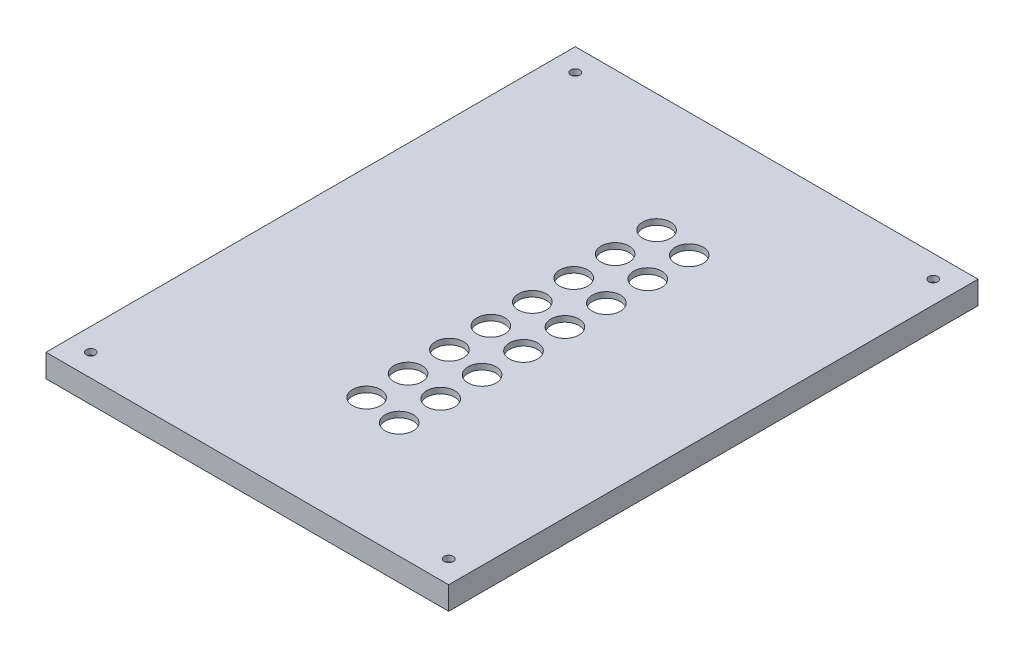
ISO-10303-21;
HEADER;
FILE_DESCRIPTION(('STEP AP214'),'2;1');
FILE_NAME('part.step','',(''),(''),'','','');
FILE_SCHEMA(('AUTOMOTIVE_DESIGN { 1 0 10303 214 1 1 1 1 }'));
ENDSEC;
DATA;
#1=APPLICATION_CONTEXT('core data for automotive mechanical design processes');
#2=APPLICATION_PROTOCOL_DEFINITION('international standard','automotive_design',2000,#1);
#3=PRODUCT_CONTEXT('',#1,'mechanical');
#4=PRODUCT('Part','Part','',(#3));
#5=PRODUCT_RELATED_PRODUCT_CATEGORY('part','',(#4));
#6=PRODUCT_DEFINITION_FORMATION('','',#4);
#7=PRODUCT_DEFINITION_CONTEXT('part definition',#1,'design');
#8=PRODUCT_DEFINITION('design','',#6,#7);
#9=PRODUCT_DEFINITION_SHAPE('','',#8);
#10=(LENGTH_UNIT() NAMED_UNIT(*) SI_UNIT(.MILLI.,.METRE.));
#11=(NAMED_UNIT(*) PLANE_ANGLE_UNIT() SI_UNIT($,.RADIAN.));
#12=(NAMED_UNIT(*) SI_UNIT($,.STERADIAN.) SOLID_ANGLE_UNIT());
#13=UNCERTAINTY_MEASURE_WITH_UNIT(LENGTH_MEASURE(1.E-05),#10,'distance_accuracy_value','');
#14=(GEOMETRIC_REPRESENTATION_CONTEXT(3) GLOBAL_UNCERTAINTY_ASSIGNED_CONTEXT((#13)) GLOBAL_UNIT_ASSIGNED_CONTEXT((#10,
#11,#12)) REPRESENTATION_CONTEXT('',''));
#15=CARTESIAN_POINT('',(0.,0.,0.));
#16=DIRECTION('',(0.,0.,1.));
#17=DIRECTION('',(1.,0.,0.));
#18=AXIS2_PLACEMENT_3D('',#15,#16,#17);
#19=CARTESIAN_POINT('',(0.,3.175,0.));
#20=DIRECTION('',(0.,1.,0.));
#21=DIRECTION('',(0.,0.,1.));
#22=AXIS2_PLACEMENT_3D('',#19,#20,#21);
#23=PLANE('',#22);
#24=CARTESIAN_POINT('',(-69.6461813930733,3.175,-110.086655576052));
#25=DIRECTION('',(0.,1.,0.));
#26=DIRECTION('',(0.,0.,1.));
#27=AXIS2_PLACEMENT_3D('',#24,#25,#26);
#28=CIRCLE('',#27,7.73912599999998);
#29=CARTESIAN_POINT('',(-69.6461813930733,3.175,-102.347529576052));
#30=VERTEX_POINT('',#29);
#31=EDGE_CURVE('E243',#30,#30,#28,.T.);
#32=ORIENTED_EDGE('',*,*,#31,.F.);
#33=EDGE_LOOP('',(#32));
#34=FACE_BOUND('',#33,.T.);
#35=CARTESIAN_POINT('',(-48.64618139661,3.175,-107.086655551295));
#36=DIRECTION('',(0.,1.,0.));
#37=DIRECTION('',(0.,0.,1.));
#38=AXIS2_PLACEMENT_3D('',#35,#36,#37);
#39=CIRCLE('',#38,7.73912599999998);
#40=CARTESIAN_POINT('',(-48.64618139661,3.175,-99.347529551295));
#41=VERTEX_POINT('',#40);
#42=EDGE_CURVE('E233',#41,#41,#39,.T.);
#43=ORIENTED_EDGE('',*,*,#42,.F.);
#44=EDGE_LOOP('',(#43));
#45=FACE_BOUND('',#44,.T.);
#46=CARTESIAN_POINT('',(-69.6461813898682,3.175,-87.2266555760518));
#47=DIRECTION('',(0.,1.,0.));
#48=DIRECTION('',(0.,0.,1.));
#49=AXIS2_PLACEMENT_3D('',#46,#47,#48);
#50=CIRCLE('',#49,7.73912599999998);
#51=CARTESIAN_POINT('',(-69.6461813898682,3.175,-79.4875295760518));
#52=VERTEX_POINT('',#51);
#53=EDGE_CURVE('E230',#52,#52,#50,.T.);
#54=ORIENTED_EDGE('',*,*,#53,.F.);
#55=EDGE_LOOP('',(#54));
#56=FACE_BOUND('',#55,.T.);
#57=CARTESIAN_POINT('',(-48.6461813934049,3.175,-84.226655551295));
#58=DIRECTION('',(0.,1.,0.));
#59=DIRECTION('',(0.,0.,1.));
#60=AXIS2_PLACEMENT_3D('',#57,#58,#59);
#61=CIRCLE('',#60,7.73912599999998);
#62=CARTESIAN_POINT('',(-48.6461813934049,3.175,-76.487529551295));
#63=VERTEX_POINT('',#62);
#64=EDGE_CURVE('E229',#63,#63,#61,.T.);
#65=ORIENTED_EDGE('',*,*,#64,.F.);
#66=EDGE_LOOP('',(#65));
#67=FACE_BOUND('',#66,.T.);
#68=CARTESIAN_POINT('',(-48.6461813901998,3.175,-61.366655551295));
#69=DIRECTION('',(0.,1.,0.));
#70=DIRECTION('',(0.,0.,1.));
#71=AXIS2_PLACEMENT_3D('',#68,#69,#70);
#72=CIRCLE('',#71,7.73912599999998);
#73=CARTESIAN_POINT('',(-48.6461813901998,3.175,-53.627529551295));
#74=VERTEX_POINT('',#73);
#75=EDGE_CURVE('E251',#74,#74,#72,.T.);
#76=ORIENTED_EDGE('',*,*,#75,.F.);
#77=EDGE_LOOP('',(#76));
#78=FACE_BOUND('',#77,.T.);
#79=CARTESIAN_POINT('',(-69.6461813866631,3.175,-64.3666555760517));
#80=DIRECTION('',(0.,1.,0.));
#81=DIRECTION('',(0.,0.,1.));
#82=AXIS2_PLACEMENT_3D('',#79,#80,#81);
#83=CIRCLE('',#82,7.73912599999998);
#84=CARTESIAN_POINT('',(-69.6461813866631,3.175,-56.6275295760518));
#85=VERTEX_POINT('',#84);
#86=EDGE_CURVE('E226',#85,#85,#83,.T.);
#87=ORIENTED_EDGE('',*,*,#86,.F.);
#88=EDGE_LOOP('',(#87));
#89=FACE_BOUND('',#88,.T.);
#90=CARTESIAN_POINT('',(-69.646181383458,3.175,-41.5066555760518));
#91=DIRECTION('',(0.,1.,0.));
#92=DIRECTION('',(0.,0.,1.));
#93=AXIS2_PLACEMENT_3D('',#90,#91,#92);
#94=CIRCLE('',#93,7.73912599999998);
#95=CARTESIAN_POINT('',(-69.646181383458,3.175,-33.7675295760518));
#96=VERTEX_POINT('',#95);
#97=EDGE_CURVE('E225',#96,#96,#94,.T.);
#98=ORIENTED_EDGE('',*,*,#97,.F.);
#99=EDGE_LOOP('',(#98));
#100=FACE_BOUND('',#99,.T.);
#101=CARTESIAN_POINT('',(-48.6461813869947,3.175,-38.506655551295));
#102=DIRECTION('',(0.,1.,0.));
#103=DIRECTION('',(0.,0.,1.));
#104=AXIS2_PLACEMENT_3D('',#101,#102,#103);
#105=CIRCLE('',#104,7.73912599999998);
#106=CARTESIAN_POINT('',(-48.6461813869947,3.175,-30.767529551295));
#107=VERTEX_POINT('',#106);
#108=EDGE_CURVE('E264',#107,#107,#105,.T.);
#109=ORIENTED_EDGE('',*,*,#108,.F.);
#110=EDGE_LOOP('',(#109));
#111=FACE_BOUND('',#110,.T.);
#112=CARTESIAN_POINT('',(-48.6461813837896,3.175,-15.646655551295));
#113=DIRECTION('',(0.,1.,0.));
#114=DIRECTION('',(0.,0.,1.));
#115=AXIS2_PLACEMENT_3D('',#112,#113,#114);
#116=CIRCLE('',#115,7.73912599999998);
#117=CARTESIAN_POINT('',(-48.6461813837896,3.175,-7.90752955129499));
#118=VERTEX_POINT('',#117);
#119=EDGE_CURVE('E221',#118,#118,#116,.T.);
#120=ORIENTED_EDGE('',*,*,#119,.F.);
#121=EDGE_LOOP('',(#120));
#122=FACE_BOUND('',#121,.T.);
#123=CARTESIAN_POINT('',(-69.646181380253,3.175,-18.6466555760518));
#124=DIRECTION('',(0.,1.,0.));
#125=DIRECTION('',(0.,0.,1.));
#126=AXIS2_PLACEMENT_3D('',#123,#124,#125);
#127=CIRCLE('',#126,7.73912599999998);
#128=CARTESIAN_POINT('',(-69.646181380253,3.175,-10.9075295760518));
#129=VERTEX_POINT('',#128);
#130=EDGE_CURVE('E220',#129,#129,#127,.T.);
#131=ORIENTED_EDGE('',*,*,#130,.F.);
#132=EDGE_LOOP('',(#131));
#133=FACE_BOUND('',#132,.T.);
#134=CARTESIAN_POINT('',(-69.6461813770479,3.175,4.21334442394824));
#135=DIRECTION('',(0.,1.,0.));
#136=DIRECTION('',(0.,0.,1.));
#137=AXIS2_PLACEMENT_3D('',#134,#135,#136);
#138=CIRCLE('',#137,7.73912599999998);
#139=CARTESIAN_POINT('',(-69.6461813770479,3.175,11.9524704239482));
#140=VERTEX_POINT('',#139);
#141=EDGE_CURVE('E216',#140,#140,#138,.T.);
#142=ORIENTED_EDGE('',*,*,#141,.F.);
#143=EDGE_LOOP('',(#142));
#144=FACE_BOUND('',#143,.T.);
#145=CARTESIAN_POINT('',(-48.6461813805845,3.175,7.21334444870503));
#146=DIRECTION('',(0.,1.,0.));
#147=DIRECTION('',(0.,0.,1.));
#148=AXIS2_PLACEMENT_3D('',#145,#146,#147);
#149=CIRCLE('',#148,7.73912599999998);
#150=CARTESIAN_POINT('',(-48.6461813805845,3.175,14.952470448705));
#151=VERTEX_POINT('',#150);
#152=EDGE_CURVE('E212',#151,#151,#149,.T.);
#153=ORIENTED_EDGE('',*,*,#152,.F.);
#154=EDGE_LOOP('',(#153));
#155=FACE_BOUND('',#154,.T.);
#156=CARTESIAN_POINT('',(-48.6461813773795,3.175,30.073344448705));
#157=DIRECTION('',(0.,1.,0.));
#158=DIRECTION('',(0.,0.,1.));
#159=AXIS2_PLACEMENT_3D('',#156,#157,#158);
#160=CIRCLE('',#159,7.73912599999998);
#161=CARTESIAN_POINT('',(-48.6461813773795,3.175,37.812470448705));
#162=VERTEX_POINT('',#161);
#163=EDGE_CURVE('E208',#162,#162,#160,.T.);
#164=ORIENTED_EDGE('',*,*,#163,.F.);
#165=EDGE_LOOP('',(#164));
#166=FACE_BOUND('',#165,.T.);
#167=CARTESIAN_POINT('',(-69.6461813738428,3.175,27.0733444239482));
#168=DIRECTION('',(0.,1.,0.));
#169=DIRECTION('',(0.,0.,1.));
#170=AXIS2_PLACEMENT_3D('',#167,#168,#169);
#171=CIRCLE('',#170,7.73912599999998);
#172=CARTESIAN_POINT('',(-69.6461813738428,3.175,34.8124704239482));
#173=VERTEX_POINT('',#172);
#174=EDGE_CURVE('E204',#173,#173,#171,.T.);
#175=ORIENTED_EDGE('',*,*,#174,.F.);
#176=EDGE_LOOP('',(#175));
#177=FACE_BOUND('',#176,.T.);
#178=CARTESIAN_POINT('',(-69.6461813706377,3.175,49.9333444239482));
#179=DIRECTION('',(0.,1.,0.));
#180=DIRECTION('',(0.,0.,1.));
#181=AXIS2_PLACEMENT_3D('',#178,#179,#180);
#182=CIRCLE('',#181,7.73912599999998);
#183=CARTESIAN_POINT('',(-69.6461813706377,3.175,57.6724704239482));
#184=VERTEX_POINT('',#183);
#185=EDGE_CURVE('E200',#184,#184,#182,.T.);
#186=ORIENTED_EDGE('',*,*,#185,.F.);
#187=EDGE_LOOP('',(#186));
#188=FACE_BOUND('',#187,.T.);
#189=CARTESIAN_POINT('',(-48.6461813741744,3.175,52.933344448705));
#190=DIRECTION('',(0.,1.,0.));
#191=DIRECTION('',(0.,0.,1.));
#192=AXIS2_PLACEMENT_3D('',#189,#190,#191);
#193=CIRCLE('',#192,7.73912599999998);
#194=CARTESIAN_POINT('',(-48.6461813741744,3.175,60.672470448705));
#195=VERTEX_POINT('',#194);
#196=EDGE_CURVE('E127',#195,#195,#193,.T.);
#197=ORIENTED_EDGE('',*,*,#196,.F.);
#198=EDGE_LOOP('',(#197));
#199=FACE_BOUND('',#198,.T.);
#200=CARTESIAN_POINT('',(30.1288186462325,3.175,104.399444444444));
#201=DIRECTION('',(0.,1.,0.));
#202=DIRECTION('',(0.,0.,1.));
#203=AXIS2_PLACEMENT_3D('',#200,#201,#202);
#204=CIRCLE('',#203,2.52729999999998);
#205=CARTESIAN_POINT('',(30.1288186462325,3.175,106.926744444444));
#206=VERTEX_POINT('',#205);
#207=EDGE_CURVE('E184',#206,#206,#204,.T.);
#208=ORIENTED_EDGE('',*,*,#207,.F.);
#209=EDGE_LOOP('',(#208));
#210=FACE_BOUND('',#209,.T.);
#211=CARTESIAN_POINT('',(-167.421181353768,3.175,104.399444444444));
#212=DIRECTION('',(0.,1.,0.));
#213=DIRECTION('',(0.,0.,1.));
#214=AXIS2_PLACEMENT_3D('',#211,#212,#213);
#215=CIRCLE('',#214,2.52729999999998);
#216=CARTESIAN_POINT('',(-167.421181353768,3.175,106.926744444444));
#217=VERTEX_POINT('',#216);
#218=EDGE_CURVE('E11',#217,#217,#215,.T.);
#219=ORIENTED_EDGE('',*,*,#218,.F.);
#220=EDGE_LOOP('',(#219));
#221=FACE_BOUND('',#220,.T.);
#222=CARTESIAN_POINT('',(-167.421181353768,3.175,-163.000555634));
#223=DIRECTION('',(0.,1.,0.));
#224=DIRECTION('',(0.,0.,1.));
#225=AXIS2_PLACEMENT_3D('',#222,#223,#224);
#226=CIRCLE('',#225,2.52729999999998);
#227=CARTESIAN_POINT('',(-167.421181353768,3.175,-160.473255634));
#228=VERTEX_POINT('',#227);
#229=EDGE_CURVE('E190',#228,#228,#226,.T.);
#230=ORIENTED_EDGE('',*,*,#229,.F.);
#231=EDGE_LOOP('',(#230));
#232=FACE_BOUND('',#231,.T.);
#233=CARTESIAN_POINT('',(30.1288186462324,3.175,-163.000555634));
#234=DIRECTION('',(0.,1.,0.));
#235=DIRECTION('',(0.,0.,1.));
#236=AXIS2_PLACEMENT_3D('',#233,#234,#235);
#237=CIRCLE('',#236,2.52729999999998);
#238=CARTESIAN_POINT('',(30.1288186462324,3.175,-160.473255634));
#239=VERTEX_POINT('',#238);
#240=EDGE_CURVE('E178',#239,#239,#237,.T.);
#241=ORIENTED_EDGE('',*,*,#240,.F.);
#242=EDGE_LOOP('',(#241));
#243=FACE_BOUND('',#242,.T.);
#244=DIRECTION('',(0.,0.,1.));
#245=VECTOR('',#244,1.);
#246=CARTESIAN_POINT('',(-179.771181353768,3.175,-175.350551));
#247=LINE('',#246,#245);
#248=CARTESIAN_POINT('',(-179.771181353768,3.175,-175.350551));
#249=VERTEX_POINT('',#248);
#250=CARTESIAN_POINT('',(-179.771181353768,3.175,116.749444444444));
#251=VERTEX_POINT('',#250);
#252=EDGE_CURVE('E135',#249,#251,#247,.T.);
#253=ORIENTED_EDGE('',*,*,#252,.T.);
#254=DIRECTION('',(1.,0.,0.));
#255=VECTOR('',#254,1.);
#256=CARTESIAN_POINT('',(-179.771181353768,3.175,116.749444444444));
#257=LINE('',#256,#255);
#258=CARTESIAN_POINT('',(42.4788186462324,3.175,116.749444444444));
#259=VERTEX_POINT('',#258);
#260=EDGE_CURVE('E155',#251,#259,#257,.T.);
#261=ORIENTED_EDGE('',*,*,#260,.T.);
#262=DIRECTION('',(0.,0.,-1.));
#263=VECTOR('',#262,1.);
#264=CARTESIAN_POINT('',(42.4788186462324,3.175,116.749444444444));
#265=LINE('',#264,#263);
#266=CARTESIAN_POINT('',(42.4788186462324,3.175,-175.350551));
#267=VERTEX_POINT('',#266);
#268=EDGE_CURVE('E158',#259,#267,#265,.T.);
#269=ORIENTED_EDGE('',*,*,#268,.T.);
#270=DIRECTION('',(-1.,0.,0.));
#271=VECTOR('',#270,1.);
#272=CARTESIAN_POINT('',(42.4788186462324,3.175,-175.350551));
#273=LINE('',#272,#271);
#274=EDGE_CURVE('E143',#267,#249,#273,.T.);
#275=ORIENTED_EDGE('',*,*,#274,.T.);
#276=EDGE_LOOP('',(#253,#261,#269,#275));
#277=FACE_BOUND('',#276,.T.);
#278=ADVANCED_FACE('F35',(#34,#45,#56,#67,#78,#89,#100,#111,#122,#133,#144,#155,#166,#177,#188,
#199,#210,#221,#232,#243,#277),#23,.T.);
#279=CARTESIAN_POINT('',(0.,0.,0.));
#280=DIRECTION('',(0.,1.,0.));
#281=DIRECTION('',(0.,0.,1.));
#282=AXIS2_PLACEMENT_3D('',#279,#280,#281);
#283=PLANE('',#282);
#284=CARTESIAN_POINT('',(-69.6461813930733,0.,-110.086655576052));
#285=DIRECTION('',(0.,1.,0.));
#286=DIRECTION('',(0.,0.,1.));
#287=AXIS2_PLACEMENT_3D('',#284,#285,#286);
#288=CIRCLE('',#287,7.73912599999999);
#289=CARTESIAN_POINT('',(-69.6461813930733,0.,-102.347529576052));
#290=VERTEX_POINT('',#289);
#291=EDGE_CURVE('E39',#290,#290,#288,.T.);
#292=ORIENTED_EDGE('',*,*,#291,.T.);
#293=EDGE_LOOP('',(#292));
#294=FACE_BOUND('',#293,.T.);
#295=CARTESIAN_POINT('',(-48.64618139661,0.,-107.086655551295));
#296=DIRECTION('',(0.,1.,0.));
#297=DIRECTION('',(0.,0.,1.));
#298=AXIS2_PLACEMENT_3D('',#295,#296,#297);
#299=CIRCLE('',#298,7.73912599999999);
#300=CARTESIAN_POINT('',(-48.64618139661,0.,-99.347529551295));
#301=VERTEX_POINT('',#300);
#302=EDGE_CURVE('E231',#301,#301,#299,.T.);
#303=ORIENTED_EDGE('',*,*,#302,.T.);
#304=EDGE_LOOP('',(#303));
#305=FACE_BOUND('',#304,.T.);
#306=CARTESIAN_POINT('',(-69.6461813898682,0.,-87.2266555760518));
#307=DIRECTION('',(0.,1.,0.));
#308=DIRECTION('',(0.,0.,1.));
#309=AXIS2_PLACEMENT_3D('',#306,#307,#308);
#310=CIRCLE('',#309,7.73912599999999);
#311=CARTESIAN_POINT('',(-69.6461813898682,0.,-79.4875295760518));
#312=VERTEX_POINT('',#311);
#313=EDGE_CURVE('E227',#312,#312,#310,.T.);
#314=ORIENTED_EDGE('',*,*,#313,.T.);
#315=EDGE_LOOP('',(#314));
#316=FACE_BOUND('',#315,.T.);
#317=CARTESIAN_POINT('',(-48.6461813934049,0.,-84.226655551295));
#318=DIRECTION('',(0.,1.,0.));
#319=DIRECTION('',(0.,0.,1.));
#320=AXIS2_PLACEMENT_3D('',#317,#318,#319);
#321=CIRCLE('',#320,7.73912599999999);
#322=CARTESIAN_POINT('',(-48.6461813934049,0.,-76.487529551295));
#323=VERTEX_POINT('',#322);
#324=EDGE_CURVE('E248',#323,#323,#321,.T.);
#325=ORIENTED_EDGE('',*,*,#324,.T.);
#326=EDGE_LOOP('',(#325));
#327=FACE_BOUND('',#326,.T.);
#328=CARTESIAN_POINT('',(-48.6461813901998,0.,-61.366655551295));
#329=DIRECTION('',(0.,1.,0.));
#330=DIRECTION('',(0.,0.,1.));
#331=AXIS2_PLACEMENT_3D('',#328,#329,#330);
#332=CIRCLE('',#331,7.73912599999999);
#333=CARTESIAN_POINT('',(-48.6461813901998,0.,-53.627529551295));
#334=VERTEX_POINT('',#333);
#335=EDGE_CURVE('E254',#334,#334,#332,.T.);
#336=ORIENTED_EDGE('',*,*,#335,.T.);
#337=EDGE_LOOP('',(#336));
#338=FACE_BOUND('',#337,.T.);
#339=CARTESIAN_POINT('',(-69.6461813866631,0.,-64.3666555760517));
#340=DIRECTION('',(0.,1.,0.));
#341=DIRECTION('',(0.,0.,1.));
#342=AXIS2_PLACEMENT_3D('',#339,#340,#341);
#343=CIRCLE('',#342,7.73912599999999);
#344=CARTESIAN_POINT('',(-69.6461813866631,0.,-56.6275295760517));
#345=VERTEX_POINT('',#344);
#346=EDGE_CURVE('E222',#345,#345,#343,.T.);
#347=ORIENTED_EDGE('',*,*,#346,.T.);
#348=EDGE_LOOP('',(#347));
#349=FACE_BOUND('',#348,.T.);
#350=CARTESIAN_POINT('',(-69.646181383458,0.,-41.5066555760518));
#351=DIRECTION('',(0.,1.,0.));
#352=DIRECTION('',(0.,0.,1.));
#353=AXIS2_PLACEMENT_3D('',#350,#351,#352);
#354=CIRCLE('',#353,7.73912599999999);
#355=CARTESIAN_POINT('',(-69.646181383458,0.,-33.7675295760518));
#356=VERTEX_POINT('',#355);
#357=EDGE_CURVE('E261',#356,#356,#354,.T.);
#358=ORIENTED_EDGE('',*,*,#357,.T.);
#359=EDGE_LOOP('',(#358));
#360=FACE_BOUND('',#359,.T.);
#361=CARTESIAN_POINT('',(-48.6461813869947,0.,-38.506655551295));
#362=DIRECTION('',(0.,1.,0.));
#363=DIRECTION('',(0.,0.,1.));
#364=AXIS2_PLACEMENT_3D('',#361,#362,#363);
#365=CIRCLE('',#364,7.73912599999999);
#366=CARTESIAN_POINT('',(-48.6461813869947,0.,-30.767529551295));
#367=VERTEX_POINT('',#366);
#368=EDGE_CURVE('E267',#367,#367,#365,.T.);
#369=ORIENTED_EDGE('',*,*,#368,.T.);
#370=EDGE_LOOP('',(#369));
#371=FACE_BOUND('',#370,.T.);
#372=CARTESIAN_POINT('',(-48.6461813837896,0.,-15.646655551295));
#373=DIRECTION('',(0.,1.,0.));
#374=DIRECTION('',(0.,0.,1.));
#375=AXIS2_PLACEMENT_3D('',#372,#373,#374);
#376=CIRCLE('',#375,7.73912599999999);
#377=CARTESIAN_POINT('',(-48.6461813837896,0.,-7.90752955129499));
#378=VERTEX_POINT('',#377);
#379=EDGE_CURVE('E217',#378,#378,#376,.T.);
#380=ORIENTED_EDGE('',*,*,#379,.T.);
#381=EDGE_LOOP('',(#380));
#382=FACE_BOUND('',#381,.T.);
#383=CARTESIAN_POINT('',(-69.646181380253,0.,-18.6466555760518));
#384=DIRECTION('',(0.,1.,0.));
#385=DIRECTION('',(0.,0.,1.));
#386=AXIS2_PLACEMENT_3D('',#383,#384,#385);
#387=CIRCLE('',#386,7.73912599999999);
#388=CARTESIAN_POINT('',(-69.646181380253,0.,-10.9075295760518));
#389=VERTEX_POINT('',#388);
#390=EDGE_CURVE('E274',#389,#389,#387,.T.);
#391=ORIENTED_EDGE('',*,*,#390,.T.);
#392=EDGE_LOOP('',(#391));
#393=FACE_BOUND('',#392,.T.);
#394=CARTESIAN_POINT('',(-69.6461813770479,0.,4.21334442394824));
#395=DIRECTION('',(0.,1.,0.));
#396=DIRECTION('',(0.,0.,1.));
#397=AXIS2_PLACEMENT_3D('',#394,#395,#396);
#398=CIRCLE('',#397,7.73912599999999);
#399=CARTESIAN_POINT('',(-69.6461813770479,0.,11.9524704239482));
#400=VERTEX_POINT('',#399);
#401=EDGE_CURVE('E213',#400,#400,#398,.T.);
#402=ORIENTED_EDGE('',*,*,#401,.T.);
#403=EDGE_LOOP('',(#402));
#404=FACE_BOUND('',#403,.T.);
#405=CARTESIAN_POINT('',(-48.6461813805845,0.,7.21334444870503));
#406=DIRECTION('',(0.,1.,0.));
#407=DIRECTION('',(0.,0.,1.));
#408=AXIS2_PLACEMENT_3D('',#405,#406,#407);
#409=CIRCLE('',#408,7.73912599999999);
#410=CARTESIAN_POINT('',(-48.6461813805845,0.,14.952470448705));
#411=VERTEX_POINT('',#410);
#412=EDGE_CURVE('E209',#411,#411,#409,.T.);
#413=ORIENTED_EDGE('',*,*,#412,.T.);
#414=EDGE_LOOP('',(#413));
#415=FACE_BOUND('',#414,.T.);
#416=CARTESIAN_POINT('',(-48.6461813773795,0.,30.073344448705));
#417=DIRECTION('',(0.,1.,0.));
#418=DIRECTION('',(0.,0.,1.));
#419=AXIS2_PLACEMENT_3D('',#416,#417,#418);
#420=CIRCLE('',#419,7.73912599999999);
#421=CARTESIAN_POINT('',(-48.6461813773795,0.,37.812470448705));
#422=VERTEX_POINT('',#421);
#423=EDGE_CURVE('E205',#422,#422,#420,.T.);
#424=ORIENTED_EDGE('',*,*,#423,.T.);
#425=EDGE_LOOP('',(#424));
#426=FACE_BOUND('',#425,.T.);
#427=CARTESIAN_POINT('',(-69.6461813738428,0.,27.0733444239482));
#428=DIRECTION('',(0.,1.,0.));
#429=DIRECTION('',(0.,0.,1.));
#430=AXIS2_PLACEMENT_3D('',#427,#428,#429);
#431=CIRCLE('',#430,7.73912599999999);
#432=CARTESIAN_POINT('',(-69.6461813738428,0.,34.8124704239482));
#433=VERTEX_POINT('',#432);
#434=EDGE_CURVE('E201',#433,#433,#431,.T.);
#435=ORIENTED_EDGE('',*,*,#434,.T.);
#436=EDGE_LOOP('',(#435));
#437=FACE_BOUND('',#436,.T.);
#438=CARTESIAN_POINT('',(-69.6461813706377,0.,49.9333444239482));
#439=DIRECTION('',(0.,1.,0.));
#440=DIRECTION('',(0.,0.,1.));
#441=AXIS2_PLACEMENT_3D('',#438,#439,#440);
#442=CIRCLE('',#441,7.73912599999999);
#443=CARTESIAN_POINT('',(-69.6461813706377,0.,57.6724704239482));
#444=VERTEX_POINT('',#443);
#445=EDGE_CURVE('E197',#444,#444,#442,.T.);
#446=ORIENTED_EDGE('',*,*,#445,.T.);
#447=EDGE_LOOP('',(#446));
#448=FACE_BOUND('',#447,.T.);
#449=CARTESIAN_POINT('',(-48.6461813741744,0.,52.933344448705));
#450=DIRECTION('',(0.,1.,0.));
#451=DIRECTION('',(0.,0.,1.));
#452=AXIS2_PLACEMENT_3D('',#449,#450,#451);
#453=CIRCLE('',#452,7.73912599999999);
#454=CARTESIAN_POINT('',(-48.6461813741744,0.,60.672470448705));
#455=VERTEX_POINT('',#454);
#456=EDGE_CURVE('E124',#455,#455,#453,.T.);
#457=ORIENTED_EDGE('',*,*,#456,.T.);
#458=EDGE_LOOP('',(#457));
#459=FACE_BOUND('',#458,.T.);
#460=CARTESIAN_POINT('',(-167.421181353768,0.,104.399444444444));
#461=DIRECTION('',(0.,1.,0.));
#462=DIRECTION('',(0.,0.,1.));
#463=AXIS2_PLACEMENT_3D('',#460,#461,#462);
#464=CIRCLE('',#463,2.52729999999998);
#465=CARTESIAN_POINT('',(-167.421181353768,0.,106.926744444444));
#466=VERTEX_POINT('',#465);
#467=EDGE_CURVE('E44',#466,#466,#464,.T.);
#468=ORIENTED_EDGE('',*,*,#467,.T.);
#469=EDGE_LOOP('',(#468));
#470=FACE_BOUND('',#469,.T.);
#471=CARTESIAN_POINT('',(-167.421181353768,0.,-163.000555634));
#472=DIRECTION('',(0.,1.,0.));
#473=DIRECTION('',(0.,0.,1.));
#474=AXIS2_PLACEMENT_3D('',#471,#472,#473);
#475=CIRCLE('',#474,2.52729999999998);
#476=CARTESIAN_POINT('',(-167.421181353768,0.,-160.473255634));
#477=VERTEX_POINT('',#476);
#478=EDGE_CURVE('E187',#477,#477,#475,.T.);
#479=ORIENTED_EDGE('',*,*,#478,.T.);
#480=EDGE_LOOP('',(#479));
#481=FACE_BOUND('',#480,.T.);
#482=CARTESIAN_POINT('',(30.1288186462325,0.,104.399444444444));
#483=DIRECTION('',(0.,1.,0.));
#484=DIRECTION('',(0.,0.,1.));
#485=AXIS2_PLACEMENT_3D('',#482,#483,#484);
#486=CIRCLE('',#485,2.52729999999998);
#487=CARTESIAN_POINT('',(30.1288186462325,0.,106.926744444444));
#488=VERTEX_POINT('',#487);
#489=EDGE_CURVE('E181',#488,#488,#486,.T.);
#490=ORIENTED_EDGE('',*,*,#489,.T.);
#491=EDGE_LOOP('',(#490));
#492=FACE_BOUND('',#491,.T.);
#493=CARTESIAN_POINT('',(30.1288186462324,0.,-163.000555634));
#494=DIRECTION('',(0.,1.,0.));
#495=DIRECTION('',(0.,0.,1.));
#496=AXIS2_PLACEMENT_3D('',#493,#494,#495);
#497=CIRCLE('',#496,2.52729999999998);
#498=CARTESIAN_POINT('',(30.1288186462324,0.,-160.473255634));
#499=VERTEX_POINT('',#498);
#500=EDGE_CURVE('E172',#499,#499,#497,.T.);
#501=ORIENTED_EDGE('',*,*,#500,.T.);
#502=EDGE_LOOP('',(#501));
#503=FACE_BOUND('',#502,.T.);
#504=DIRECTION('',(0.,0.,1.));
#505=VECTOR('',#504,1.);
#506=CARTESIAN_POINT('',(37.7163186462324,0.,0.));
#507=LINE('',#506,#505);
#508=CARTESIAN_POINT('',(37.7163186462324,0.,-170.588051));
#509=VERTEX_POINT('',#508);
#510=CARTESIAN_POINT('',(37.7163186462324,0.,111.986944444444));
#511=VERTEX_POINT('',#510);
#512=EDGE_CURVE('E165',#509,#511,#507,.T.);
#513=ORIENTED_EDGE('',*,*,#512,.T.);
#514=DIRECTION('',(-1.,0.,0.));
#515=VECTOR('',#514,1.);
#516=CARTESIAN_POINT('',(0.,0.,111.986944444444));
#517=LINE('',#516,#515);
#518=CARTESIAN_POINT('',(-175.008681353768,0.,111.986944444444));
#519=VERTEX_POINT('',#518);
#520=EDGE_CURVE('E175',#511,#519,#517,.T.);
#521=ORIENTED_EDGE('',*,*,#520,.T.);
#522=DIRECTION('',(0.,0.,-1.));
#523=VECTOR('',#522,1.);
#524=CARTESIAN_POINT('',(-175.008681353768,0.,0.));
#525=LINE('',#524,#523);
#526=CARTESIAN_POINT('',(-175.008681353768,0.,-170.588051));
#527=VERTEX_POINT('',#526);
#528=EDGE_CURVE('E107',#519,#527,#525,.T.);
#529=ORIENTED_EDGE('',*,*,#528,.T.);
#530=DIRECTION('',(1.,0.,0.));
#531=VECTOR('',#530,1.);
#532=CARTESIAN_POINT('',(0.,0.,-170.588051));
#533=LINE('',#532,#531);
#534=EDGE_CURVE('E60',#527,#509,#533,.T.);
#535=ORIENTED_EDGE('',*,*,#534,.T.);
#536=EDGE_LOOP('',(#513,#521,#529,#535));
#537=FACE_BOUND('',#536,.T.);
#538=ADVANCED_FACE('F37',(#294,#305,#316,#327,#338,#349,#360,#371,#382,#393,#404,#415,#426,#437,
#448,#459,#470,#481,#492,#503,#537),#283,.F.);
#539=CARTESIAN_POINT('',(-167.421181353768,3.175,104.399444444444));
#540=DIRECTION('',(0.,-1.,0.));
#541=DIRECTION('',(0.,0.,-1.));
#542=AXIS2_PLACEMENT_3D('',#539,#540,#541);
#543=CYLINDRICAL_SURFACE('',#542,2.52729999999998);
#544=ORIENTED_EDGE('',*,*,#218,.T.);
#545=EDGE_LOOP('',(#544));
#546=FACE_BOUND('',#545,.T.);
#547=ORIENTED_EDGE('',*,*,#467,.F.);
#548=EDGE_LOOP('',(#547));
#549=FACE_BOUND('',#548,.T.);
#550=ADVANCED_FACE('F350',(#546,#549),#543,.F.);
#551=CARTESIAN_POINT('',(-167.421181353768,3.175,-163.000555634));
#552=DIRECTION('',(0.,-1.,0.));
#553=DIRECTION('',(0.,0.,-1.));
#554=AXIS2_PLACEMENT_3D('',#551,#552,#553);
#555=CYLINDRICAL_SURFACE('',#554,2.52729999999998);
#556=ORIENTED_EDGE('',*,*,#229,.T.);
#557=EDGE_LOOP('',(#556));
#558=FACE_BOUND('',#557,.T.);
#559=ORIENTED_EDGE('',*,*,#478,.F.);
#560=EDGE_LOOP('',(#559));
#561=FACE_BOUND('',#560,.T.);
#562=ADVANCED_FACE('F346',(#558,#561),#555,.F.);
#563=CARTESIAN_POINT('',(30.1288186462325,3.175,104.399444444444));
#564=DIRECTION('',(0.,-1.,0.));
#565=DIRECTION('',(0.,0.,-1.));
#566=AXIS2_PLACEMENT_3D('',#563,#564,#565);
#567=CYLINDRICAL_SURFACE('',#566,2.52729999999998);
#568=ORIENTED_EDGE('',*,*,#207,.T.);
#569=EDGE_LOOP('',(#568));
#570=FACE_BOUND('',#569,.T.);
#571=ORIENTED_EDGE('',*,*,#489,.F.);
#572=EDGE_LOOP('',(#571));
#573=FACE_BOUND('',#572,.T.);
#574=ADVANCED_FACE('F342',(#570,#573),#567,.F.);
#575=CARTESIAN_POINT('',(30.1288186462324,3.175,-163.000555634));
#576=DIRECTION('',(0.,-1.,0.));
#577=DIRECTION('',(0.,0.,-1.));
#578=AXIS2_PLACEMENT_3D('',#575,#576,#577);
#579=CYLINDRICAL_SURFACE('',#578,2.52729999999998);
#580=ORIENTED_EDGE('',*,*,#240,.T.);
#581=EDGE_LOOP('',(#580));
#582=FACE_BOUND('',#581,.T.);
#583=ORIENTED_EDGE('',*,*,#500,.F.);
#584=EDGE_LOOP('',(#583));
#585=FACE_BOUND('',#584,.T.);
#586=ADVANCED_FACE('F338',(#582,#585),#579,.F.);
#587=CARTESIAN_POINT('',(37.7163186462324,-9.525,-170.588051));
#588=DIRECTION('',(0.,0.,-1.));
#589=DIRECTION('',(-1.,0.,0.));
#590=AXIS2_PLACEMENT_3D('',#587,#588,#589);
#591=PLANE('',#590);
#592=DIRECTION('',(0.,1.,0.));
#593=VECTOR('',#592,1.);
#594=CARTESIAN_POINT('',(37.7163186462324,-9.525,-170.588051));
#595=LINE('',#594,#593);
#596=CARTESIAN_POINT('',(37.7163186462324,-9.525,-170.588051));
#597=VERTEX_POINT('',#596);
#598=EDGE_CURVE('E136',#597,#509,#595,.T.);
#599=ORIENTED_EDGE('',*,*,#598,.T.);
#600=ORIENTED_EDGE('',*,*,#534,.F.);
#601=DIRECTION('',(0.,1.,0.));
#602=VECTOR('',#601,1.);
#603=CARTESIAN_POINT('',(-175.008681353768,-9.525,-170.588051));
#604=LINE('',#603,#602);
#605=CARTESIAN_POINT('',(-175.008681353768,-9.525,-170.588051));
#606=VERTEX_POINT('',#605);
#607=EDGE_CURVE('E133',#606,#527,#604,.T.);
#608=ORIENTED_EDGE('',*,*,#607,.F.);
#609=DIRECTION('',(-1.,0.,0.));
#610=VECTOR('',#609,1.);
#611=CARTESIAN_POINT('',(37.7163186462324,-9.525,-170.588051));
#612=LINE('',#611,#610);
#613=EDGE_CURVE('E110',#597,#606,#612,.T.);
#614=ORIENTED_EDGE('',*,*,#613,.F.);
#615=EDGE_LOOP('',(#599,#600,#608,#614));
#616=FACE_BOUND('',#615,.T.);
#617=ADVANCED_FACE('F341',(#616),#591,.F.);
#618=CARTESIAN_POINT('',(-175.008681353768,-9.525,111.986944444444));
#619=DIRECTION('',(0.,0.,1.));
#620=DIRECTION('',(1.,0.,0.));
#621=AXIS2_PLACEMENT_3D('',#618,#619,#620);
#622=PLANE('',#621);
#623=DIRECTION('',(0.,1.,0.));
#624=VECTOR('',#623,1.);
#625=CARTESIAN_POINT('',(-175.008681353768,-9.525,111.986944444444));
#626=LINE('',#625,#624);
#627=CARTESIAN_POINT('',(-175.008681353768,-9.525,111.986944444444));
#628=VERTEX_POINT('',#627);
#629=EDGE_CURVE('E52',#628,#519,#626,.T.);
#630=ORIENTED_EDGE('',*,*,#629,.T.);
#631=ORIENTED_EDGE('',*,*,#520,.F.);
#632=DIRECTION('',(0.,1.,0.));
#633=VECTOR('',#632,1.);
#634=CARTESIAN_POINT('',(37.7163186462324,-9.525,111.986944444444));
#635=LINE('',#634,#633);
#636=CARTESIAN_POINT('',(37.7163186462324,-9.525,111.986944444444));
#637=VERTEX_POINT('',#636);
#638=EDGE_CURVE('E109',#637,#511,#635,.T.);
#639=ORIENTED_EDGE('',*,*,#638,.F.);
#640=DIRECTION('',(1.,0.,0.));
#641=VECTOR('',#640,1.);
#642=CARTESIAN_POINT('',(-175.008681353768,-9.525,111.986944444444));
#643=LINE('',#642,#641);
#644=EDGE_CURVE('E114',#628,#637,#643,.T.);
#645=ORIENTED_EDGE('',*,*,#644,.F.);
#646=EDGE_LOOP('',(#630,#631,#639,#645));
#647=FACE_BOUND('',#646,.T.);
#648=ADVANCED_FACE('F115',(#647),#622,.F.);
#649=CARTESIAN_POINT('',(-175.008681353768,-9.525,-170.588051));
#650=DIRECTION('',(-1.,0.,0.));
#651=DIRECTION('',(0.,0.,1.));
#652=AXIS2_PLACEMENT_3D('',#649,#650,#651);
#653=PLANE('',#652);
#654=ORIENTED_EDGE('',*,*,#607,.T.);
#655=ORIENTED_EDGE('',*,*,#528,.F.);
#656=ORIENTED_EDGE('',*,*,#629,.F.);
#657=DIRECTION('',(0.,0.,1.));
#658=VECTOR('',#657,1.);
#659=CARTESIAN_POINT('',(-175.008681353768,-9.525,-170.588051));
#660=LINE('',#659,#658);
#661=EDGE_CURVE('E104',#606,#628,#660,.T.);
#662=ORIENTED_EDGE('',*,*,#661,.F.);
#663=EDGE_LOOP('',(#654,#655,#656,#662));
#664=FACE_BOUND('',#663,.T.);
#665=ADVANCED_FACE('F102',(#664),#653,.F.);
#666=CARTESIAN_POINT('',(37.7163186462324,-9.525,111.986944444444));
#667=DIRECTION('',(1.,0.,0.));
#668=DIRECTION('',(0.,0.,-1.));
#669=AXIS2_PLACEMENT_3D('',#666,#667,#668);
#670=PLANE('',#669);
#671=ORIENTED_EDGE('',*,*,#638,.T.);
#672=ORIENTED_EDGE('',*,*,#512,.F.);
#673=ORIENTED_EDGE('',*,*,#598,.F.);
#674=DIRECTION('',(0.,0.,-1.));
#675=VECTOR('',#674,1.);
#676=CARTESIAN_POINT('',(37.7163186462324,-9.525,111.986944444444));
#677=LINE('',#676,#675);
#678=EDGE_CURVE('E119',#637,#597,#677,.T.);
#679=ORIENTED_EDGE('',*,*,#678,.F.);
#680=EDGE_LOOP('',(#671,#672,#673,#679));
#681=FACE_BOUND('',#680,.T.);
#682=ADVANCED_FACE('F337',(#681),#670,.F.);
#683=CARTESIAN_POINT('',(-179.771181353768,-9.525,-175.350551));
#684=DIRECTION('',(-1.,0.,0.));
#685=DIRECTION('',(0.,0.,1.));
#686=AXIS2_PLACEMENT_3D('',#683,#684,#685);
#687=PLANE('',#686);
#688=ORIENTED_EDGE('',*,*,#252,.F.);
#689=DIRECTION('',(0.,1.,0.));
#690=VECTOR('',#689,1.);
#691=CARTESIAN_POINT('',(-179.771181353768,-9.525,-175.350551));
#692=LINE('',#691,#690);
#693=CARTESIAN_POINT('',(-179.771181353768,-9.525,-175.350551));
#694=VERTEX_POINT('',#693);
#695=EDGE_CURVE('E163',#694,#249,#692,.T.);
#696=ORIENTED_EDGE('',*,*,#695,.F.);
#697=DIRECTION('',(0.,0.,1.));
#698=VECTOR('',#697,1.);
#699=CARTESIAN_POINT('',(-179.771181353768,-9.525,-175.350551));
#700=LINE('',#699,#698);
#701=CARTESIAN_POINT('',(-179.771181353768,-9.525,116.749444444444));
#702=VERTEX_POINT('',#701);
#703=EDGE_CURVE('E139',#694,#702,#700,.T.);
#704=ORIENTED_EDGE('',*,*,#703,.T.);
#705=DIRECTION('',(0.,1.,0.));
#706=VECTOR('',#705,1.);
#707=CARTESIAN_POINT('',(-179.771181353768,-9.525,116.749444444444));
#708=LINE('',#707,#706);
#709=EDGE_CURVE('E152',#702,#251,#708,.T.);
#710=ORIENTED_EDGE('',*,*,#709,.T.);
#711=EDGE_LOOP('',(#688,#696,#704,#710));
#712=FACE_BOUND('',#711,.T.);
#713=ADVANCED_FACE('F307',(#712),#687,.T.);
#714=CARTESIAN_POINT('',(42.4788186462324,-9.525,-175.350551));
#715=DIRECTION('',(0.,0.,-1.));
#716=DIRECTION('',(-1.,0.,0.));
#717=AXIS2_PLACEMENT_3D('',#714,#715,#716);
#718=PLANE('',#717);
#719=ORIENTED_EDGE('',*,*,#274,.F.);
#720=DIRECTION('',(0.,1.,0.));
#721=VECTOR('',#720,1.);
#722=CARTESIAN_POINT('',(42.4788186462324,-9.525,-175.350551));
#723=LINE('',#722,#721);
#724=CARTESIAN_POINT('',(42.4788186462324,-9.525,-175.350551));
#725=VERTEX_POINT('',#724);
#726=EDGE_CURVE('E166',#725,#267,#723,.T.);
#727=ORIENTED_EDGE('',*,*,#726,.F.);
#728=DIRECTION('',(-1.,0.,0.));
#729=VECTOR('',#728,1.);
#730=CARTESIAN_POINT('',(42.4788186462324,-9.525,-175.350551));
#731=LINE('',#730,#729);
#732=EDGE_CURVE('E149',#725,#694,#731,.T.);
#733=ORIENTED_EDGE('',*,*,#732,.T.);
#734=ORIENTED_EDGE('',*,*,#695,.T.);
#735=EDGE_LOOP('',(#719,#727,#733,#734));
#736=FACE_BOUND('',#735,.T.);
#737=ADVANCED_FACE('F317',(#736),#718,.T.);
#738=CARTESIAN_POINT('',(42.4788186462324,-9.525,116.749444444444));
#739=DIRECTION('',(1.,0.,0.));
#740=DIRECTION('',(0.,0.,-1.));
#741=AXIS2_PLACEMENT_3D('',#738,#739,#740);
#742=PLANE('',#741);
#743=ORIENTED_EDGE('',*,*,#268,.F.);
#744=DIRECTION('',(0.,1.,0.));
#745=VECTOR('',#744,1.);
#746=CARTESIAN_POINT('',(42.4788186462324,-9.525,116.749444444444));
#747=LINE('',#746,#745);
#748=CARTESIAN_POINT('',(42.4788186462324,-9.525,116.749444444444));
#749=VERTEX_POINT('',#748);
#750=EDGE_CURVE('E168',#749,#259,#747,.T.);
#751=ORIENTED_EDGE('',*,*,#750,.F.);
#752=DIRECTION('',(0.,0.,-1.));
#753=VECTOR('',#752,1.);
#754=CARTESIAN_POINT('',(42.4788186462324,-9.525,116.749444444444));
#755=LINE('',#754,#753);
#756=EDGE_CURVE('E146',#749,#725,#755,.T.);
#757=ORIENTED_EDGE('',*,*,#756,.T.);
#758=ORIENTED_EDGE('',*,*,#726,.T.);
#759=EDGE_LOOP('',(#743,#751,#757,#758));
#760=FACE_BOUND('',#759,.T.);
#761=ADVANCED_FACE('F315',(#760),#742,.T.);
#762=CARTESIAN_POINT('',(-179.771181353768,-9.525,116.749444444444));
#763=DIRECTION('',(0.,0.,1.));
#764=DIRECTION('',(1.,0.,0.));
#765=AXIS2_PLACEMENT_3D('',#762,#763,#764);
#766=PLANE('',#765);
#767=ORIENTED_EDGE('',*,*,#260,.F.);
#768=ORIENTED_EDGE('',*,*,#709,.F.);
#769=DIRECTION('',(1.,0.,0.));
#770=VECTOR('',#769,1.);
#771=CARTESIAN_POINT('',(-179.771181353768,-9.525,116.749444444444));
#772=LINE('',#771,#770);
#773=EDGE_CURVE('E142',#702,#749,#772,.T.);
#774=ORIENTED_EDGE('',*,*,#773,.T.);
#775=ORIENTED_EDGE('',*,*,#750,.T.);
#776=EDGE_LOOP('',(#767,#768,#774,#775));
#777=FACE_BOUND('',#776,.T.);
#778=ADVANCED_FACE('F311',(#777),#766,.T.);
#779=CARTESIAN_POINT('',(0.,-9.525,0.));
#780=DIRECTION('',(0.,1.,0.));
#781=DIRECTION('',(0.,0.,1.));
#782=AXIS2_PLACEMENT_3D('',#779,#780,#781);
#783=PLANE('',#782);
#784=ORIENTED_EDGE('',*,*,#613,.T.);
#785=ORIENTED_EDGE('',*,*,#661,.T.);
#786=ORIENTED_EDGE('',*,*,#644,.T.);
#787=ORIENTED_EDGE('',*,*,#678,.T.);
#788=EDGE_LOOP('',(#784,#785,#786,#787));
#789=FACE_BOUND('',#788,.T.);
#790=ORIENTED_EDGE('',*,*,#703,.F.);
#791=ORIENTED_EDGE('',*,*,#732,.F.);
#792=ORIENTED_EDGE('',*,*,#756,.F.);
#793=ORIENTED_EDGE('',*,*,#773,.F.);
#794=EDGE_LOOP('',(#790,#791,#792,#793));
#795=FACE_BOUND('',#794,.T.);
#796=ADVANCED_FACE('F121',(#789,#795),#783,.F.);
#797=CARTESIAN_POINT('',(-48.6461813741744,3.175,52.933344448705));
#798=DIRECTION('',(0.,1.,0.));
#799=DIRECTION('',(0.,0.,1.));
#800=AXIS2_PLACEMENT_3D('',#797,#798,#799);
#801=CYLINDRICAL_SURFACE('',#800,7.73912599999999);
#802=ORIENTED_EDGE('',*,*,#196,.T.);
#803=EDGE_LOOP('',(#802));
#804=FACE_BOUND('',#803,.T.);
#805=ORIENTED_EDGE('',*,*,#456,.F.);
#806=EDGE_LOOP('',(#805));
#807=FACE_BOUND('',#806,.T.);
#808=ADVANCED_FACE('F289',(#804,#807),#801,.F.);
#809=CARTESIAN_POINT('',(-69.6461813706377,3.175,49.9333444239482));
#810=DIRECTION('',(0.,1.,0.));
#811=DIRECTION('',(0.,0.,1.));
#812=AXIS2_PLACEMENT_3D('',#809,#810,#811);
#813=CYLINDRICAL_SURFACE('',#812,7.73912599999999);
#814=ORIENTED_EDGE('',*,*,#185,.T.);
#815=EDGE_LOOP('',(#814));
#816=FACE_BOUND('',#815,.T.);
#817=ORIENTED_EDGE('',*,*,#445,.F.);
#818=EDGE_LOOP('',(#817));
#819=FACE_BOUND('',#818,.T.);
#820=ADVANCED_FACE('F325',(#816,#819),#813,.F.);
#821=CARTESIAN_POINT('',(-69.6461813738428,3.175,27.0733444239482));
#822=DIRECTION('',(0.,1.,0.));
#823=DIRECTION('',(0.,0.,1.));
#824=AXIS2_PLACEMENT_3D('',#821,#822,#823);
#825=CYLINDRICAL_SURFACE('',#824,7.73912599999999);
#826=ORIENTED_EDGE('',*,*,#174,.T.);
#827=EDGE_LOOP('',(#826));
#828=FACE_BOUND('',#827,.T.);
#829=ORIENTED_EDGE('',*,*,#434,.F.);
#830=EDGE_LOOP('',(#829));
#831=FACE_BOUND('',#830,.T.);
#832=ADVANCED_FACE('F482',(#828,#831),#825,.F.);
#833=CARTESIAN_POINT('',(-48.6461813773795,3.175,30.073344448705));
#834=DIRECTION('',(0.,1.,0.));
#835=DIRECTION('',(0.,0.,1.));
#836=AXIS2_PLACEMENT_3D('',#833,#834,#835);
#837=CYLINDRICAL_SURFACE('',#836,7.73912599999999);
#838=ORIENTED_EDGE('',*,*,#163,.T.);
#839=EDGE_LOOP('',(#838));
#840=FACE_BOUND('',#839,.T.);
#841=ORIENTED_EDGE('',*,*,#423,.F.);
#842=EDGE_LOOP('',(#841));
#843=FACE_BOUND('',#842,.T.);
#844=ADVANCED_FACE('F491',(#840,#843),#837,.F.);
#845=CARTESIAN_POINT('',(-48.6461813805845,3.175,7.21334444870503));
#846=DIRECTION('',(0.,1.,0.));
#847=DIRECTION('',(0.,0.,1.));
#848=AXIS2_PLACEMENT_3D('',#845,#846,#847);
#849=CYLINDRICAL_SURFACE('',#848,7.73912599999999);
#850=ORIENTED_EDGE('',*,*,#152,.T.);
#851=EDGE_LOOP('',(#850));
#852=FACE_BOUND('',#851,.T.);
#853=ORIENTED_EDGE('',*,*,#412,.F.);
#854=EDGE_LOOP('',(#853));
#855=FACE_BOUND('',#854,.T.);
#856=ADVANCED_FACE('F501',(#852,#855),#849,.F.);
#857=CARTESIAN_POINT('',(-69.6461813770479,3.175,4.21334442394824));
#858=DIRECTION('',(0.,1.,0.));
#859=DIRECTION('',(0.,0.,1.));
#860=AXIS2_PLACEMENT_3D('',#857,#858,#859);
#861=CYLINDRICAL_SURFACE('',#860,7.73912599999999);
#862=ORIENTED_EDGE('',*,*,#141,.T.);
#863=EDGE_LOOP('',(#862));
#864=FACE_BOUND('',#863,.T.);
#865=ORIENTED_EDGE('',*,*,#401,.F.);
#866=EDGE_LOOP('',(#865));
#867=FACE_BOUND('',#866,.T.);
#868=ADVANCED_FACE('F511',(#864,#867),#861,.F.);
#869=CARTESIAN_POINT('',(-69.646181380253,3.175,-18.6466555760518));
#870=DIRECTION('',(0.,1.,0.));
#871=DIRECTION('',(0.,0.,1.));
#872=AXIS2_PLACEMENT_3D('',#869,#870,#871);
#873=CYLINDRICAL_SURFACE('',#872,7.73912599999999);
#874=ORIENTED_EDGE('',*,*,#130,.T.);
#875=EDGE_LOOP('',(#874));
#876=FACE_BOUND('',#875,.T.);
#877=ORIENTED_EDGE('',*,*,#390,.F.);
#878=EDGE_LOOP('',(#877));
#879=FACE_BOUND('',#878,.T.);
#880=ADVANCED_FACE('F521',(#876,#879),#873,.F.);
#881=CARTESIAN_POINT('',(-48.6461813837896,3.175,-15.646655551295));
#882=DIRECTION('',(0.,1.,0.));
#883=DIRECTION('',(0.,0.,1.));
#884=AXIS2_PLACEMENT_3D('',#881,#882,#883);
#885=CYLINDRICAL_SURFACE('',#884,7.73912599999999);
#886=ORIENTED_EDGE('',*,*,#119,.T.);
#887=EDGE_LOOP('',(#886));
#888=FACE_BOUND('',#887,.T.);
#889=ORIENTED_EDGE('',*,*,#379,.F.);
#890=EDGE_LOOP('',(#889));
#891=FACE_BOUND('',#890,.T.);
#892=ADVANCED_FACE('F531',(#888,#891),#885,.F.);
#893=CARTESIAN_POINT('',(-48.6461813869947,3.175,-38.506655551295));
#894=DIRECTION('',(0.,1.,0.));
#895=DIRECTION('',(0.,0.,1.));
#896=AXIS2_PLACEMENT_3D('',#893,#894,#895);
#897=CYLINDRICAL_SURFACE('',#896,7.73912599999999);
#898=ORIENTED_EDGE('',*,*,#108,.T.);
#899=EDGE_LOOP('',(#898));
#900=FACE_BOUND('',#899,.T.);
#901=ORIENTED_EDGE('',*,*,#368,.F.);
#902=EDGE_LOOP('',(#901));
#903=FACE_BOUND('',#902,.T.);
#904=ADVANCED_FACE('F541',(#900,#903),#897,.F.);
#905=CARTESIAN_POINT('',(-69.646181383458,3.175,-41.5066555760518));
#906=DIRECTION('',(0.,1.,0.));
#907=DIRECTION('',(0.,0.,1.));
#908=AXIS2_PLACEMENT_3D('',#905,#906,#907);
#909=CYLINDRICAL_SURFACE('',#908,7.73912599999999);
#910=ORIENTED_EDGE('',*,*,#97,.T.);
#911=EDGE_LOOP('',(#910));
#912=FACE_BOUND('',#911,.T.);
#913=ORIENTED_EDGE('',*,*,#357,.F.);
#914=EDGE_LOOP('',(#913));
#915=FACE_BOUND('',#914,.T.);
#916=ADVANCED_FACE('F551',(#912,#915),#909,.F.);
#917=CARTESIAN_POINT('',(-69.6461813866631,3.175,-64.3666555760517));
#918=DIRECTION('',(0.,1.,0.));
#919=DIRECTION('',(0.,0.,1.));
#920=AXIS2_PLACEMENT_3D('',#917,#918,#919);
#921=CYLINDRICAL_SURFACE('',#920,7.73912599999999);
#922=ORIENTED_EDGE('',*,*,#86,.T.);
#923=EDGE_LOOP('',(#922));
#924=FACE_BOUND('',#923,.T.);
#925=ORIENTED_EDGE('',*,*,#346,.F.);
#926=EDGE_LOOP('',(#925));
#927=FACE_BOUND('',#926,.T.);
#928=ADVANCED_FACE('F561',(#924,#927),#921,.F.);
#929=CARTESIAN_POINT('',(-48.6461813901998,3.175,-61.366655551295));
#930=DIRECTION('',(0.,1.,0.));
#931=DIRECTION('',(0.,0.,1.));
#932=AXIS2_PLACEMENT_3D('',#929,#930,#931);
#933=CYLINDRICAL_SURFACE('',#932,7.73912599999999);
#934=ORIENTED_EDGE('',*,*,#75,.T.);
#935=EDGE_LOOP('',(#934));
#936=FACE_BOUND('',#935,.T.);
#937=ORIENTED_EDGE('',*,*,#335,.F.);
#938=EDGE_LOOP('',(#937));
#939=FACE_BOUND('',#938,.T.);
#940=ADVANCED_FACE('F571',(#936,#939),#933,.F.);
#941=CARTESIAN_POINT('',(-48.6461813934049,3.175,-84.226655551295));
#942=DIRECTION('',(0.,1.,0.));
#943=DIRECTION('',(0.,0.,1.));
#944=AXIS2_PLACEMENT_3D('',#941,#942,#943);
#945=CYLINDRICAL_SURFACE('',#944,7.73912599999999);
#946=ORIENTED_EDGE('',*,*,#64,.T.);
#947=EDGE_LOOP('',(#946));
#948=FACE_BOUND('',#947,.T.);
#949=ORIENTED_EDGE('',*,*,#324,.F.);
#950=EDGE_LOOP('',(#949));
#951=FACE_BOUND('',#950,.T.);
#952=ADVANCED_FACE('F581',(#948,#951),#945,.F.);
#953=CARTESIAN_POINT('',(-69.6461813898682,3.175,-87.2266555760518));
#954=DIRECTION('',(0.,1.,0.));
#955=DIRECTION('',(0.,0.,1.));
#956=AXIS2_PLACEMENT_3D('',#953,#954,#955);
#957=CYLINDRICAL_SURFACE('',#956,7.73912599999999);
#958=ORIENTED_EDGE('',*,*,#53,.T.);
#959=EDGE_LOOP('',(#958));
#960=FACE_BOUND('',#959,.T.);
#961=ORIENTED_EDGE('',*,*,#313,.F.);
#962=EDGE_LOOP('',(#961));
#963=FACE_BOUND('',#962,.T.);
#964=ADVANCED_FACE('F591',(#960,#963),#957,.F.);
#965=CARTESIAN_POINT('',(-48.64618139661,3.175,-107.086655551295));
#966=DIRECTION('',(0.,1.,0.));
#967=DIRECTION('',(0.,0.,1.));
#968=AXIS2_PLACEMENT_3D('',#965,#966,#967);
#969=CYLINDRICAL_SURFACE('',#968,7.73912599999999);
#970=ORIENTED_EDGE('',*,*,#42,.T.);
#971=EDGE_LOOP('',(#970));
#972=FACE_BOUND('',#971,.T.);
#973=ORIENTED_EDGE('',*,*,#302,.F.);
#974=EDGE_LOOP('',(#973));
#975=FACE_BOUND('',#974,.T.);
#976=ADVANCED_FACE('F601',(#972,#975),#969,.F.);
#977=CARTESIAN_POINT('',(-69.6461813930733,3.175,-110.086655576052));
#978=DIRECTION('',(0.,1.,0.));
#979=DIRECTION('',(0.,0.,1.));
#980=AXIS2_PLACEMENT_3D('',#977,#978,#979);
#981=CYLINDRICAL_SURFACE('',#980,7.73912599999999);
#982=ORIENTED_EDGE('',*,*,#31,.T.);
#983=EDGE_LOOP('',(#982));
#984=FACE_BOUND('',#983,.T.);
#985=ORIENTED_EDGE('',*,*,#291,.F.);
#986=EDGE_LOOP('',(#985));
#987=FACE_BOUND('',#986,.T.);
#988=ADVANCED_FACE('F611',(#984,#987),#981,.F.);
#989=CLOSED_SHELL('',(#278,#538,#550,#562,#574,#586,#617,#648,#665,#682,#713,#737,#761,#778,
#796,#808,#820,#832,#844,#856,#868,#880,#892,#904,#916,#928,#940,#952,#964,#976,#988));
#990=MANIFOLD_SOLID_BREP('B2',#989);
#991=ADVANCED_BREP_SHAPE_REPRESENTATION('',(#18,#990),#14);
#992=SHAPE_DEFINITION_REPRESENTATION(#9,#991);
ENDSEC;
END-ISO-10303-21;
